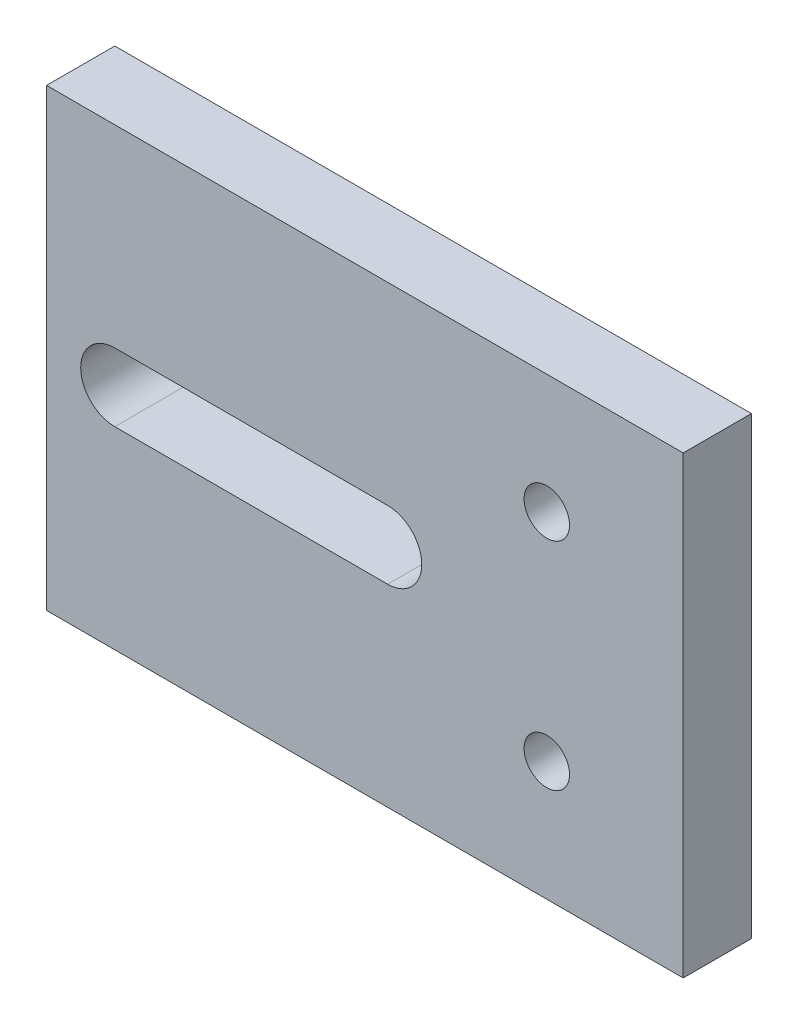
ISO-10303-21;
HEADER;
FILE_DESCRIPTION(('STEP AP214'),'2;1');
FILE_NAME('part.step','',(''),(''),'','','');
FILE_SCHEMA(('AUTOMOTIVE_DESIGN { 1 0 10303 214 1 1 1 1 }'));
ENDSEC;
DATA;
#1=APPLICATION_CONTEXT('core data for automotive mechanical design processes');
#2=APPLICATION_PROTOCOL_DEFINITION('international standard','automotive_design',2000,#1);
#3=PRODUCT_CONTEXT('',#1,'mechanical');
#4=PRODUCT('Part','Part','',(#3));
#5=PRODUCT_RELATED_PRODUCT_CATEGORY('part','',(#4));
#6=PRODUCT_DEFINITION_FORMATION('','',#4);
#7=PRODUCT_DEFINITION_CONTEXT('part definition',#1,'design');
#8=PRODUCT_DEFINITION('design','',#6,#7);
#9=PRODUCT_DEFINITION_SHAPE('','',#8);
#10=(LENGTH_UNIT() NAMED_UNIT(*) SI_UNIT(.MILLI.,.METRE.));
#11=(NAMED_UNIT(*) PLANE_ANGLE_UNIT() SI_UNIT($,.RADIAN.));
#12=(NAMED_UNIT(*) SI_UNIT($,.STERADIAN.) SOLID_ANGLE_UNIT());
#13=UNCERTAINTY_MEASURE_WITH_UNIT(LENGTH_MEASURE(1.E-05),#10,'distance_accuracy_value','');
#14=(GEOMETRIC_REPRESENTATION_CONTEXT(3) GLOBAL_UNCERTAINTY_ASSIGNED_CONTEXT((#13)) GLOBAL_UNIT_ASSIGNED_CONTEXT((#10,
#11,#12)) REPRESENTATION_CONTEXT('',''));
#15=CARTESIAN_POINT('',(0.,0.,0.));
#16=DIRECTION('',(0.,0.,1.));
#17=DIRECTION('',(1.,0.,0.));
#18=AXIS2_PLACEMENT_3D('',#15,#16,#17);
#19=CARTESIAN_POINT('',(0.,0.,3.));
#20=DIRECTION('',(0.,0.,1.));
#21=DIRECTION('',(1.,0.,0.));
#22=AXIS2_PLACEMENT_3D('',#19,#20,#21);
#23=PLANE('',#22);
#24=CARTESIAN_POINT('',(1.,0.,3.));
#25=DIRECTION('',(0.,0.,1.));
#26=DIRECTION('',(1.,0.,0.));
#27=AXIS2_PLACEMENT_3D('',#24,#25,#26);
#28=CIRCLE('',#27,1.5);
#29=CARTESIAN_POINT('',(1.,-1.5,3.));
#30=VERTEX_POINT('',#29);
#31=CARTESIAN_POINT('',(1.,1.5,3.));
#32=VERTEX_POINT('',#31);
#33=EDGE_CURVE('E54',#30,#32,#28,.T.);
#34=ORIENTED_EDGE('',*,*,#33,.F.);
#35=DIRECTION('',(1.,0.,0.));
#36=VECTOR('',#35,1.);
#37=CARTESIAN_POINT('',(1.,-1.5,3.));
#38=LINE('',#37,#36);
#39=CARTESIAN_POINT('',(-11.,-1.5,3.));
#40=VERTEX_POINT('',#39);
#41=EDGE_CURVE('E122',#40,#30,#38,.T.);
#42=ORIENTED_EDGE('',*,*,#41,.F.);
#43=CARTESIAN_POINT('',(-11.,0.,3.));
#44=DIRECTION('',(0.,0.,1.));
#45=DIRECTION('',(1.,0.,0.));
#46=AXIS2_PLACEMENT_3D('',#43,#44,#45);
#47=CIRCLE('',#46,1.5);
#48=CARTESIAN_POINT('',(-11.,1.5,3.));
#49=VERTEX_POINT('',#48);
#50=EDGE_CURVE('E125',#49,#40,#47,.T.);
#51=ORIENTED_EDGE('',*,*,#50,.F.);
#52=DIRECTION('',(-1.,0.,0.));
#53=VECTOR('',#52,1.);
#54=CARTESIAN_POINT('',(1.,1.5,3.));
#55=LINE('',#54,#53);
#56=EDGE_CURVE('E131',#32,#49,#55,.T.);
#57=ORIENTED_EDGE('',*,*,#56,.F.);
#58=EDGE_LOOP('',(#34,#42,#51,#57));
#59=FACE_BOUND('',#58,.T.);
#60=CARTESIAN_POINT('',(8.,4.75,3.));
#61=DIRECTION('',(0.,0.,1.));
#62=DIRECTION('',(1.,0.,0.));
#63=AXIS2_PLACEMENT_3D('',#60,#61,#62);
#64=CIRCLE('',#63,1.);
#65=CARTESIAN_POINT('',(9.,4.75,3.));
#66=VERTEX_POINT('',#65);
#67=EDGE_CURVE('E148',#66,#66,#64,.T.);
#68=ORIENTED_EDGE('',*,*,#67,.F.);
#69=EDGE_LOOP('',(#68));
#70=FACE_BOUND('',#69,.T.);
#71=DIRECTION('',(0.,-1.,0.));
#72=VECTOR('',#71,1.);
#73=CARTESIAN_POINT('',(-14.,-10.,3.));
#74=LINE('',#73,#72);
#75=CARTESIAN_POINT('',(-14.,10.,3.));
#76=VERTEX_POINT('',#75);
#77=CARTESIAN_POINT('',(-14.,-10.,3.));
#78=VERTEX_POINT('',#77);
#79=EDGE_CURVE('E154',#76,#78,#74,.T.);
#80=ORIENTED_EDGE('',*,*,#79,.T.);
#81=DIRECTION('',(1.,0.,0.));
#82=VECTOR('',#81,1.);
#83=CARTESIAN_POINT('',(14.,-10.,3.));
#84=LINE('',#83,#82);
#85=CARTESIAN_POINT('',(14.,-10.,3.));
#86=VERTEX_POINT('',#85);
#87=EDGE_CURVE('E158',#78,#86,#84,.T.);
#88=ORIENTED_EDGE('',*,*,#87,.T.);
#89=DIRECTION('',(0.,1.,0.));
#90=VECTOR('',#89,1.);
#91=CARTESIAN_POINT('',(14.,-10.,3.));
#92=LINE('',#91,#90);
#93=CARTESIAN_POINT('',(14.,10.,3.));
#94=VERTEX_POINT('',#93);
#95=EDGE_CURVE('E161',#86,#94,#92,.T.);
#96=ORIENTED_EDGE('',*,*,#95,.T.);
#97=DIRECTION('',(-1.,0.,0.));
#98=VECTOR('',#97,1.);
#99=CARTESIAN_POINT('',(14.,10.,3.));
#100=LINE('',#99,#98);
#101=EDGE_CURVE('E164',#94,#76,#100,.T.);
#102=ORIENTED_EDGE('',*,*,#101,.T.);
#103=EDGE_LOOP('',(#80,#88,#96,#102));
#104=FACE_BOUND('',#103,.T.);
#105=CARTESIAN_POINT('',(8.,-4.75,3.));
#106=DIRECTION('',(0.,0.,1.));
#107=DIRECTION('',(1.,0.,0.));
#108=AXIS2_PLACEMENT_3D('',#105,#106,#107);
#109=CIRCLE('',#108,1.);
#110=CARTESIAN_POINT('',(9.,-4.75,3.));
#111=VERTEX_POINT('',#110);
#112=EDGE_CURVE('E141',#111,#111,#109,.T.);
#113=ORIENTED_EDGE('',*,*,#112,.F.);
#114=EDGE_LOOP('',(#113));
#115=FACE_BOUND('',#114,.T.);
#116=ADVANCED_FACE('F39',(#59,#70,#104,#115),#23,.T.);
#117=CARTESIAN_POINT('',(0.,0.,0.));
#118=DIRECTION('',(0.,0.,1.));
#119=DIRECTION('',(1.,0.,0.));
#120=AXIS2_PLACEMENT_3D('',#117,#118,#119);
#121=PLANE('',#120);
#122=DIRECTION('',(1.,0.,0.));
#123=VECTOR('',#122,1.);
#124=CARTESIAN_POINT('',(1.,-1.5,0.));
#125=LINE('',#124,#123);
#126=CARTESIAN_POINT('',(-11.,-1.5,0.));
#127=VERTEX_POINT('',#126);
#128=CARTESIAN_POINT('',(1.,-1.5,0.));
#129=VERTEX_POINT('',#128);
#130=EDGE_CURVE('E112',#127,#129,#125,.T.);
#131=ORIENTED_EDGE('',*,*,#130,.T.);
#132=CARTESIAN_POINT('',(1.,0.,0.));
#133=DIRECTION('',(0.,0.,1.));
#134=DIRECTION('',(1.,0.,0.));
#135=AXIS2_PLACEMENT_3D('',#132,#133,#134);
#136=CIRCLE('',#135,1.5);
#137=CARTESIAN_POINT('',(1.,1.5,0.));
#138=VERTEX_POINT('',#137);
#139=EDGE_CURVE('E106',#129,#138,#136,.T.);
#140=ORIENTED_EDGE('',*,*,#139,.T.);
#141=DIRECTION('',(-1.,0.,0.));
#142=VECTOR('',#141,1.);
#143=CARTESIAN_POINT('',(1.,1.5,0.));
#144=LINE('',#143,#142);
#145=CARTESIAN_POINT('',(-11.,1.5,0.));
#146=VERTEX_POINT('',#145);
#147=EDGE_CURVE('E115',#138,#146,#144,.T.);
#148=ORIENTED_EDGE('',*,*,#147,.T.);
#149=CARTESIAN_POINT('',(-11.,0.,0.));
#150=DIRECTION('',(0.,0.,1.));
#151=DIRECTION('',(1.,0.,0.));
#152=AXIS2_PLACEMENT_3D('',#149,#150,#151);
#153=CIRCLE('',#152,1.5);
#154=EDGE_CURVE('E62',#146,#127,#153,.T.);
#155=ORIENTED_EDGE('',*,*,#154,.T.);
#156=EDGE_LOOP('',(#131,#140,#148,#155));
#157=FACE_BOUND('',#156,.T.);
#158=DIRECTION('',(0.,-1.,0.));
#159=VECTOR('',#158,1.);
#160=CARTESIAN_POINT('',(-14.,-10.,0.));
#161=LINE('',#160,#159);
#162=CARTESIAN_POINT('',(-14.,10.,0.));
#163=VERTEX_POINT('',#162);
#164=CARTESIAN_POINT('',(-14.,-10.,0.));
#165=VERTEX_POINT('',#164);
#166=EDGE_CURVE('E151',#163,#165,#161,.T.);
#167=ORIENTED_EDGE('',*,*,#166,.F.);
#168=DIRECTION('',(-1.,0.,0.));
#169=VECTOR('',#168,1.);
#170=CARTESIAN_POINT('',(14.,10.,0.));
#171=LINE('',#170,#169);
#172=CARTESIAN_POINT('',(14.,10.,0.));
#173=VERTEX_POINT('',#172);
#174=EDGE_CURVE('E159',#173,#163,#171,.T.);
#175=ORIENTED_EDGE('',*,*,#174,.F.);
#176=DIRECTION('',(0.,1.,0.));
#177=VECTOR('',#176,1.);
#178=CARTESIAN_POINT('',(14.,-10.,0.));
#179=LINE('',#178,#177);
#180=CARTESIAN_POINT('',(14.,-10.,0.));
#181=VERTEX_POINT('',#180);
#182=EDGE_CURVE('E172',#181,#173,#179,.T.);
#183=ORIENTED_EDGE('',*,*,#182,.F.);
#184=DIRECTION('',(1.,0.,0.));
#185=VECTOR('',#184,1.);
#186=CARTESIAN_POINT('',(14.,-10.,0.));
#187=LINE('',#186,#185);
#188=EDGE_CURVE('E169',#165,#181,#187,.T.);
#189=ORIENTED_EDGE('',*,*,#188,.F.);
#190=EDGE_LOOP('',(#167,#175,#183,#189));
#191=FACE_BOUND('',#190,.T.);
#192=CARTESIAN_POINT('',(8.,4.75,0.));
#193=DIRECTION('',(0.,0.,1.));
#194=DIRECTION('',(1.,0.,0.));
#195=AXIS2_PLACEMENT_3D('',#192,#193,#194);
#196=CIRCLE('',#195,1.);
#197=CARTESIAN_POINT('',(9.,4.75,0.));
#198=VERTEX_POINT('',#197);
#199=EDGE_CURVE('E144',#198,#198,#196,.T.);
#200=ORIENTED_EDGE('',*,*,#199,.T.);
#201=EDGE_LOOP('',(#200));
#202=FACE_BOUND('',#201,.T.);
#203=CARTESIAN_POINT('',(8.,-4.75,0.));
#204=DIRECTION('',(0.,0.,1.));
#205=DIRECTION('',(1.,0.,0.));
#206=AXIS2_PLACEMENT_3D('',#203,#204,#205);
#207=CIRCLE('',#206,1.);
#208=CARTESIAN_POINT('',(9.,-4.75,0.));
#209=VERTEX_POINT('',#208);
#210=EDGE_CURVE('E137',#209,#209,#207,.T.);
#211=ORIENTED_EDGE('',*,*,#210,.T.);
#212=EDGE_LOOP('',(#211));
#213=FACE_BOUND('',#212,.T.);
#214=ADVANCED_FACE('F119',(#157,#191,#202,#213),#121,.F.);
#215=CARTESIAN_POINT('',(-14.,-10.,3.));
#216=DIRECTION('',(1.,0.,0.));
#217=DIRECTION('',(0.,0.,-1.));
#218=AXIS2_PLACEMENT_3D('',#215,#216,#217);
#219=PLANE('',#218);
#220=ORIENTED_EDGE('',*,*,#166,.T.);
#221=DIRECTION('',(0.,0.,-1.));
#222=VECTOR('',#221,1.);
#223=CARTESIAN_POINT('',(-14.,-10.,3.));
#224=LINE('',#223,#222);
#225=EDGE_CURVE('E11',#78,#165,#224,.T.);
#226=ORIENTED_EDGE('',*,*,#225,.F.);
#227=ORIENTED_EDGE('',*,*,#79,.F.);
#228=DIRECTION('',(0.,0.,-1.));
#229=VECTOR('',#228,1.);
#230=CARTESIAN_POINT('',(-14.,10.,3.));
#231=LINE('',#230,#229);
#232=EDGE_CURVE('E166',#76,#163,#231,.T.);
#233=ORIENTED_EDGE('',*,*,#232,.T.);
#234=EDGE_LOOP('',(#220,#226,#227,#233));
#235=FACE_BOUND('',#234,.T.);
#236=ADVANCED_FACE('F41',(#235),#219,.F.);
#237=CARTESIAN_POINT('',(14.,-10.,3.));
#238=DIRECTION('',(0.,1.,0.));
#239=DIRECTION('',(-1.,0.,0.));
#240=AXIS2_PLACEMENT_3D('',#237,#238,#239);
#241=PLANE('',#240);
#242=ORIENTED_EDGE('',*,*,#188,.T.);
#243=DIRECTION('',(0.,0.,-1.));
#244=VECTOR('',#243,1.);
#245=CARTESIAN_POINT('',(14.,-10.,3.));
#246=LINE('',#245,#244);
#247=EDGE_CURVE('E47',#86,#181,#246,.T.);
#248=ORIENTED_EDGE('',*,*,#247,.F.);
#249=ORIENTED_EDGE('',*,*,#87,.F.);
#250=ORIENTED_EDGE('',*,*,#225,.T.);
#251=EDGE_LOOP('',(#242,#248,#249,#250));
#252=FACE_BOUND('',#251,.T.);
#253=ADVANCED_FACE('F201',(#252),#241,.F.);
#254=CARTESIAN_POINT('',(14.,-10.,3.));
#255=DIRECTION('',(-1.,0.,0.));
#256=DIRECTION('',(0.,0.,1.));
#257=AXIS2_PLACEMENT_3D('',#254,#255,#256);
#258=PLANE('',#257);
#259=ORIENTED_EDGE('',*,*,#182,.T.);
#260=DIRECTION('',(0.,0.,-1.));
#261=VECTOR('',#260,1.);
#262=CARTESIAN_POINT('',(14.,10.,3.));
#263=LINE('',#262,#261);
#264=EDGE_CURVE('E179',#94,#173,#263,.T.);
#265=ORIENTED_EDGE('',*,*,#264,.F.);
#266=ORIENTED_EDGE('',*,*,#95,.F.);
#267=ORIENTED_EDGE('',*,*,#247,.T.);
#268=EDGE_LOOP('',(#259,#265,#266,#267));
#269=FACE_BOUND('',#268,.T.);
#270=ADVANCED_FACE('F186',(#269),#258,.F.);
#271=CARTESIAN_POINT('',(14.,10.,3.));
#272=DIRECTION('',(0.,-1.,0.));
#273=DIRECTION('',(1.,0.,0.));
#274=AXIS2_PLACEMENT_3D('',#271,#272,#273);
#275=PLANE('',#274);
#276=ORIENTED_EDGE('',*,*,#174,.T.);
#277=ORIENTED_EDGE('',*,*,#232,.F.);
#278=ORIENTED_EDGE('',*,*,#101,.F.);
#279=ORIENTED_EDGE('',*,*,#264,.T.);
#280=EDGE_LOOP('',(#276,#277,#278,#279));
#281=FACE_BOUND('',#280,.T.);
#282=ADVANCED_FACE('F194',(#281),#275,.F.);
#283=CARTESIAN_POINT('',(8.,4.75,3.));
#284=DIRECTION('',(0.,0.,-1.));
#285=DIRECTION('',(-1.,0.,0.));
#286=AXIS2_PLACEMENT_3D('',#283,#284,#285);
#287=CYLINDRICAL_SURFACE('',#286,1.);
#288=ORIENTED_EDGE('',*,*,#67,.T.);
#289=EDGE_LOOP('',(#288));
#290=FACE_BOUND('',#289,.T.);
#291=ORIENTED_EDGE('',*,*,#199,.F.);
#292=EDGE_LOOP('',(#291));
#293=FACE_BOUND('',#292,.T.);
#294=ADVANCED_FACE('F217',(#290,#293),#287,.F.);
#295=CARTESIAN_POINT('',(8.,-4.75,3.));
#296=DIRECTION('',(0.,0.,-1.));
#297=DIRECTION('',(-1.,0.,0.));
#298=AXIS2_PLACEMENT_3D('',#295,#296,#297);
#299=CYLINDRICAL_SURFACE('',#298,1.);
#300=ORIENTED_EDGE('',*,*,#112,.T.);
#301=EDGE_LOOP('',(#300));
#302=FACE_BOUND('',#301,.T.);
#303=ORIENTED_EDGE('',*,*,#210,.F.);
#304=EDGE_LOOP('',(#303));
#305=FACE_BOUND('',#304,.T.);
#306=ADVANCED_FACE('F224',(#302,#305),#299,.F.);
#307=CARTESIAN_POINT('',(1.,0.,0.));
#308=DIRECTION('',(0.,0.,1.));
#309=DIRECTION('',(1.,0.,0.));
#310=AXIS2_PLACEMENT_3D('',#307,#308,#309);
#311=CYLINDRICAL_SURFACE('',#310,1.5);
#312=ORIENTED_EDGE('',*,*,#33,.T.);
#313=DIRECTION('',(0.,0.,1.));
#314=VECTOR('',#313,1.);
#315=CARTESIAN_POINT('',(1.,1.5,0.));
#316=LINE('',#315,#314);
#317=EDGE_CURVE('E102',#138,#32,#316,.T.);
#318=ORIENTED_EDGE('',*,*,#317,.F.);
#319=ORIENTED_EDGE('',*,*,#139,.F.);
#320=DIRECTION('',(0.,0.,1.));
#321=VECTOR('',#320,1.);
#322=CARTESIAN_POINT('',(1.,-1.5,0.));
#323=LINE('',#322,#321);
#324=EDGE_CURVE('E135',#129,#30,#323,.T.);
#325=ORIENTED_EDGE('',*,*,#324,.T.);
#326=EDGE_LOOP('',(#312,#318,#319,#325));
#327=FACE_BOUND('',#326,.T.);
#328=ADVANCED_FACE('F104',(#327),#311,.F.);
#329=CARTESIAN_POINT('',(1.,-1.5,0.));
#330=DIRECTION('',(0.,-1.,0.));
#331=DIRECTION('',(1.,0.,0.));
#332=AXIS2_PLACEMENT_3D('',#329,#330,#331);
#333=PLANE('',#332);
#334=ORIENTED_EDGE('',*,*,#41,.T.);
#335=ORIENTED_EDGE('',*,*,#324,.F.);
#336=ORIENTED_EDGE('',*,*,#130,.F.);
#337=DIRECTION('',(0.,0.,1.));
#338=VECTOR('',#337,1.);
#339=CARTESIAN_POINT('',(-11.,-1.5,0.));
#340=LINE('',#339,#338);
#341=EDGE_CURVE('E138',#127,#40,#340,.T.);
#342=ORIENTED_EDGE('',*,*,#341,.T.);
#343=EDGE_LOOP('',(#334,#335,#336,#342));
#344=FACE_BOUND('',#343,.T.);
#345=ADVANCED_FACE('F239',(#344),#333,.F.);
#346=CARTESIAN_POINT('',(-11.,0.,0.));
#347=DIRECTION('',(0.,0.,1.));
#348=DIRECTION('',(1.,0.,0.));
#349=AXIS2_PLACEMENT_3D('',#346,#347,#348);
#350=CYLINDRICAL_SURFACE('',#349,1.5);
#351=ORIENTED_EDGE('',*,*,#50,.T.);
#352=ORIENTED_EDGE('',*,*,#341,.F.);
#353=ORIENTED_EDGE('',*,*,#154,.F.);
#354=DIRECTION('',(0.,0.,1.));
#355=VECTOR('',#354,1.);
#356=CARTESIAN_POINT('',(-11.,1.5,0.));
#357=LINE('',#356,#355);
#358=EDGE_CURVE('E111',#146,#49,#357,.T.);
#359=ORIENTED_EDGE('',*,*,#358,.T.);
#360=EDGE_LOOP('',(#351,#352,#353,#359));
#361=FACE_BOUND('',#360,.T.);
#362=ADVANCED_FACE('F244',(#361),#350,.F.);
#363=CARTESIAN_POINT('',(1.,1.5,0.));
#364=DIRECTION('',(0.,1.,0.));
#365=DIRECTION('',(-1.,0.,0.));
#366=AXIS2_PLACEMENT_3D('',#363,#364,#365);
#367=PLANE('',#366);
#368=ORIENTED_EDGE('',*,*,#56,.T.);
#369=ORIENTED_EDGE('',*,*,#358,.F.);
#370=ORIENTED_EDGE('',*,*,#147,.F.);
#371=ORIENTED_EDGE('',*,*,#317,.T.);
#372=EDGE_LOOP('',(#368,#369,#370,#371));
#373=FACE_BOUND('',#372,.T.);
#374=ADVANCED_FACE('F116',(#373),#367,.F.);
#375=CLOSED_SHELL('',(#116,#214,#236,#253,#270,#282,#294,#306,#328,#345,#362,#374));
#376=MANIFOLD_SOLID_BREP('B2',#375);
#377=ADVANCED_BREP_SHAPE_REPRESENTATION('',(#18,#376),#14);
#378=SHAPE_DEFINITION_REPRESENTATION(#9,#377);
ENDSEC;
END-ISO-10303-21;
